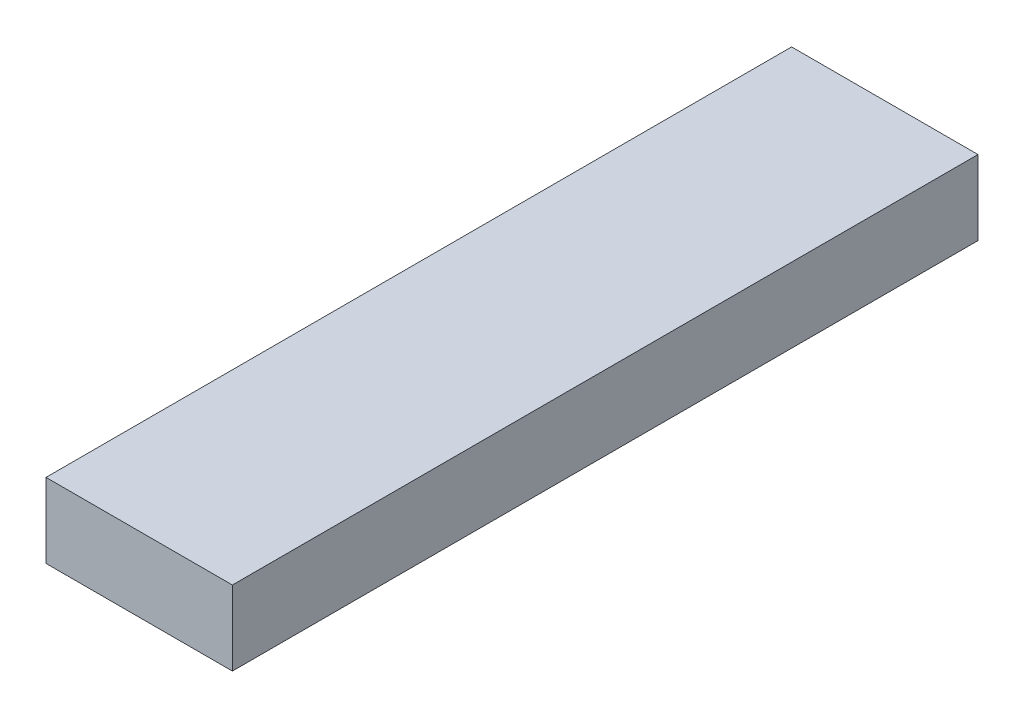
ISO-10303-21;
HEADER;
FILE_DESCRIPTION(('STEP AP214'),'2;1');
FILE_NAME('part.step','',(''),(''),'','','');
FILE_SCHEMA(('AUTOMOTIVE_DESIGN { 1 0 10303 214 1 1 1 1 }'));
ENDSEC;
DATA;
#1=APPLICATION_CONTEXT('core data for automotive mechanical design processes');
#2=APPLICATION_PROTOCOL_DEFINITION('international standard','automotive_design',2000,#1);
#3=PRODUCT_CONTEXT('',#1,'mechanical');
#4=PRODUCT('Part','Part','',(#3));
#5=PRODUCT_RELATED_PRODUCT_CATEGORY('part','',(#4));
#6=PRODUCT_DEFINITION_FORMATION('','',#4);
#7=PRODUCT_DEFINITION_CONTEXT('part definition',#1,'design');
#8=PRODUCT_DEFINITION('design','',#6,#7);
#9=PRODUCT_DEFINITION_SHAPE('','',#8);
#10=(LENGTH_UNIT() NAMED_UNIT(*) SI_UNIT(.MILLI.,.METRE.));
#11=(NAMED_UNIT(*) PLANE_ANGLE_UNIT() SI_UNIT($,.RADIAN.));
#12=(NAMED_UNIT(*) SI_UNIT($,.STERADIAN.) SOLID_ANGLE_UNIT());
#13=UNCERTAINTY_MEASURE_WITH_UNIT(LENGTH_MEASURE(1.E-05),#10,'distance_accuracy_value','');
#14=(GEOMETRIC_REPRESENTATION_CONTEXT(3) GLOBAL_UNCERTAINTY_ASSIGNED_CONTEXT((#13)) GLOBAL_UNIT_ASSIGNED_CONTEXT((#10,
#11,#12)) REPRESENTATION_CONTEXT('',''));
#15=CARTESIAN_POINT('',(0.,0.,0.));
#16=DIRECTION('',(0.,0.,1.));
#17=DIRECTION('',(1.,0.,0.));
#18=AXIS2_PLACEMENT_3D('',#15,#16,#17);
#19=CARTESIAN_POINT('',(50.,10.,0.));
#20=DIRECTION('',(0.,0.,1.));
#21=DIRECTION('',(1.,0.,0.));
#22=AXIS2_PLACEMENT_3D('',#19,#20,#21);
#23=PLANE('',#22);
#24=DIRECTION('',(-1.,0.,0.));
#25=VECTOR('',#24,1.);
#26=CARTESIAN_POINT('',(50.,-10.,0.));
#27=LINE('',#26,#25);
#28=CARTESIAN_POINT('',(50.,-10.,0.));
#29=VERTEX_POINT('',#28);
#30=CARTESIAN_POINT('',(0.,-10.,0.));
#31=VERTEX_POINT('',#30);
#32=EDGE_CURVE('E107',#29,#31,#27,.T.);
#33=ORIENTED_EDGE('',*,*,#32,.T.);
#34=DIRECTION('',(0.,-1.,0.));
#35=VECTOR('',#34,1.);
#36=CARTESIAN_POINT('',(0.,10.,0.));
#37=LINE('',#36,#35);
#38=CARTESIAN_POINT('',(0.,10.,0.));
#39=VERTEX_POINT('',#38);
#40=EDGE_CURVE('E11',#39,#31,#37,.T.);
#41=ORIENTED_EDGE('',*,*,#40,.F.);
#42=DIRECTION('',(-1.,0.,0.));
#43=VECTOR('',#42,1.);
#44=CARTESIAN_POINT('',(50.,10.,0.));
#45=LINE('',#44,#43);
#46=CARTESIAN_POINT('',(50.,10.,0.));
#47=VERTEX_POINT('',#46);
#48=EDGE_CURVE('E91',#47,#39,#45,.T.);
#49=ORIENTED_EDGE('',*,*,#48,.F.);
#50=DIRECTION('',(0.,-1.,0.));
#51=VECTOR('',#50,1.);
#52=CARTESIAN_POINT('',(50.,10.,0.));
#53=LINE('',#52,#51);
#54=EDGE_CURVE('E103',#47,#29,#53,.T.);
#55=ORIENTED_EDGE('',*,*,#54,.T.);
#56=EDGE_LOOP('',(#33,#41,#49,#55));
#57=FACE_BOUND('',#56,.T.);
#58=ADVANCED_FACE('F39',(#57),#23,.F.);
#59=CARTESIAN_POINT('',(0.,10.,0.));
#60=DIRECTION('',(1.,0.,0.));
#61=DIRECTION('',(0.,0.,-1.));
#62=AXIS2_PLACEMENT_3D('',#59,#60,#61);
#63=PLANE('',#62);
#64=DIRECTION('',(0.,0.,1.));
#65=VECTOR('',#64,1.);
#66=CARTESIAN_POINT('',(0.,-10.,0.));
#67=LINE('',#66,#65);
#68=CARTESIAN_POINT('',(0.,-10.,200.));
#69=VERTEX_POINT('',#68);
#70=EDGE_CURVE('E96',#31,#69,#67,.T.);
#71=ORIENTED_EDGE('',*,*,#70,.T.);
#72=DIRECTION('',(0.,-1.,0.));
#73=VECTOR('',#72,1.);
#74=CARTESIAN_POINT('',(0.,10.,200.));
#75=LINE('',#74,#73);
#76=CARTESIAN_POINT('',(0.,10.,200.));
#77=VERTEX_POINT('',#76);
#78=EDGE_CURVE('E48',#77,#69,#75,.T.);
#79=ORIENTED_EDGE('',*,*,#78,.F.);
#80=DIRECTION('',(0.,0.,1.));
#81=VECTOR('',#80,1.);
#82=CARTESIAN_POINT('',(0.,10.,0.));
#83=LINE('',#82,#81);
#84=EDGE_CURVE('E86',#39,#77,#83,.T.);
#85=ORIENTED_EDGE('',*,*,#84,.F.);
#86=ORIENTED_EDGE('',*,*,#40,.T.);
#87=EDGE_LOOP('',(#71,#79,#85,#86));
#88=FACE_BOUND('',#87,.T.);
#89=ADVANCED_FACE('F95',(#88),#63,.F.);
#90=CARTESIAN_POINT('',(0.,10.,200.));
#91=DIRECTION('',(0.,0.,-1.));
#92=DIRECTION('',(-1.,0.,0.));
#93=AXIS2_PLACEMENT_3D('',#90,#91,#92);
#94=PLANE('',#93);
#95=DIRECTION('',(1.,0.,0.));
#96=VECTOR('',#95,1.);
#97=CARTESIAN_POINT('',(0.,-10.,200.));
#98=LINE('',#97,#96);
#99=CARTESIAN_POINT('',(50.,-10.,200.));
#100=VERTEX_POINT('',#99);
#101=EDGE_CURVE('E73',#69,#100,#98,.T.);
#102=ORIENTED_EDGE('',*,*,#101,.T.);
#103=DIRECTION('',(0.,-1.,0.));
#104=VECTOR('',#103,1.);
#105=CARTESIAN_POINT('',(50.,10.,200.));
#106=LINE('',#105,#104);
#107=CARTESIAN_POINT('',(50.,10.,200.));
#108=VERTEX_POINT('',#107);
#109=EDGE_CURVE('E98',#108,#100,#106,.T.);
#110=ORIENTED_EDGE('',*,*,#109,.F.);
#111=DIRECTION('',(1.,0.,0.));
#112=VECTOR('',#111,1.);
#113=CARTESIAN_POINT('',(0.,10.,200.));
#114=LINE('',#113,#112);
#115=EDGE_CURVE('E89',#77,#108,#114,.T.);
#116=ORIENTED_EDGE('',*,*,#115,.F.);
#117=ORIENTED_EDGE('',*,*,#78,.T.);
#118=EDGE_LOOP('',(#102,#110,#116,#117));
#119=FACE_BOUND('',#118,.T.);
#120=ADVANCED_FACE('F99',(#119),#94,.F.);
#121=CARTESIAN_POINT('',(50.,10.,200.));
#122=DIRECTION('',(-1.,0.,0.));
#123=DIRECTION('',(0.,0.,1.));
#124=AXIS2_PLACEMENT_3D('',#121,#122,#123);
#125=PLANE('',#124);
#126=DIRECTION('',(0.,0.,-1.));
#127=VECTOR('',#126,1.);
#128=CARTESIAN_POINT('',(50.,-10.,200.));
#129=LINE('',#128,#127);
#130=EDGE_CURVE('E79',#100,#29,#129,.T.);
#131=ORIENTED_EDGE('',*,*,#130,.T.);
#132=ORIENTED_EDGE('',*,*,#54,.F.);
#133=DIRECTION('',(0.,0.,-1.));
#134=VECTOR('',#133,1.);
#135=CARTESIAN_POINT('',(50.,10.,200.));
#136=LINE('',#135,#134);
#137=EDGE_CURVE('E56',#108,#47,#136,.T.);
#138=ORIENTED_EDGE('',*,*,#137,.F.);
#139=ORIENTED_EDGE('',*,*,#109,.T.);
#140=EDGE_LOOP('',(#131,#132,#138,#139));
#141=FACE_BOUND('',#140,.T.);
#142=ADVANCED_FACE('F120',(#141),#125,.F.);
#143=CARTESIAN_POINT('',(0.,10.,0.));
#144=DIRECTION('',(0.,1.,0.));
#145=DIRECTION('',(0.,0.,1.));
#146=AXIS2_PLACEMENT_3D('',#143,#144,#145);
#147=PLANE('',#146);
#148=ORIENTED_EDGE('',*,*,#48,.T.);
#149=ORIENTED_EDGE('',*,*,#84,.T.);
#150=ORIENTED_EDGE('',*,*,#115,.T.);
#151=ORIENTED_EDGE('',*,*,#137,.T.);
#152=EDGE_LOOP('',(#148,#149,#150,#151));
#153=FACE_BOUND('',#152,.T.);
#154=ADVANCED_FACE('F87',(#153),#147,.T.);
#155=CARTESIAN_POINT('',(0.,-10.,0.));
#156=DIRECTION('',(0.,1.,0.));
#157=DIRECTION('',(0.,0.,1.));
#158=AXIS2_PLACEMENT_3D('',#155,#156,#157);
#159=PLANE('',#158);
#160=ORIENTED_EDGE('',*,*,#32,.F.);
#161=ORIENTED_EDGE('',*,*,#130,.F.);
#162=ORIENTED_EDGE('',*,*,#101,.F.);
#163=ORIENTED_EDGE('',*,*,#70,.F.);
#164=EDGE_LOOP('',(#160,#161,#162,#163));
#165=FACE_BOUND('',#164,.T.);
#166=ADVANCED_FACE('F123',(#165),#159,.F.);
#167=CLOSED_SHELL('',(#58,#89,#120,#142,#154,#166));
#168=MANIFOLD_SOLID_BREP('B2',#167);
#169=ADVANCED_BREP_SHAPE_REPRESENTATION('',(#18,#168),#14);
#170=SHAPE_DEFINITION_REPRESENTATION(#9,#169);
ENDSEC;
END-ISO-10303-21;
